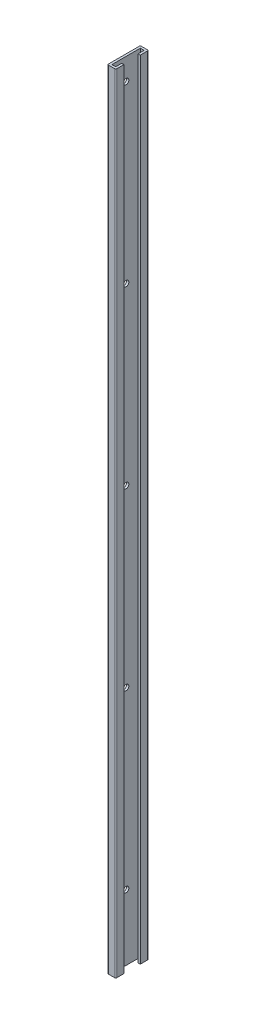
ISO-10303-21;
HEADER;
FILE_DESCRIPTION(('STEP AP214'),'2;1');
FILE_NAME('part.step','',(''),(''),'','','');
FILE_SCHEMA(('AUTOMOTIVE_DESIGN { 1 0 10303 214 1 1 1 1 }'));
ENDSEC;
DATA;
#1=APPLICATION_CONTEXT('core data for automotive mechanical design processes');
#2=APPLICATION_PROTOCOL_DEFINITION('international standard','automotive_design',2000,#1);
#3=PRODUCT_CONTEXT('',#1,'mechanical');
#4=PRODUCT('Part','Part','',(#3));
#5=PRODUCT_RELATED_PRODUCT_CATEGORY('part','',(#4));
#6=PRODUCT_DEFINITION_FORMATION('','',#4);
#7=PRODUCT_DEFINITION_CONTEXT('part definition',#1,'design');
#8=PRODUCT_DEFINITION('design','',#6,#7);
#9=PRODUCT_DEFINITION_SHAPE('','',#8);
#10=(LENGTH_UNIT() NAMED_UNIT(*) SI_UNIT(.MILLI.,.METRE.));
#11=(NAMED_UNIT(*) PLANE_ANGLE_UNIT() SI_UNIT($,.RADIAN.));
#12=(NAMED_UNIT(*) SI_UNIT($,.STERADIAN.) SOLID_ANGLE_UNIT());
#13=UNCERTAINTY_MEASURE_WITH_UNIT(LENGTH_MEASURE(1.E-05),#10,'distance_accuracy_value','');
#14=(GEOMETRIC_REPRESENTATION_CONTEXT(3) GLOBAL_UNCERTAINTY_ASSIGNED_CONTEXT((#13)) GLOBAL_UNIT_ASSIGNED_CONTEXT((#10,
#11,#12)) REPRESENTATION_CONTEXT('',''));
#15=CARTESIAN_POINT('',(0.,0.,0.));
#16=DIRECTION('',(0.,0.,1.));
#17=DIRECTION('',(1.,0.,0.));
#18=AXIS2_PLACEMENT_3D('',#15,#16,#17);
#19=CARTESIAN_POINT('',(2.54,914.4,0.));
#20=DIRECTION('',(0.,0.,1.));
#21=DIRECTION('',(1.,0.,0.));
#22=AXIS2_PLACEMENT_3D('',#19,#20,#21);
#23=PLANE('',#22);
#24=DIRECTION('',(-1.,0.,0.));
#25=VECTOR('',#24,1.);
#26=CARTESIAN_POINT('',(2.54,0.,0.));
#27=LINE('',#26,#25);
#28=CARTESIAN_POINT('',(6.985,0.,0.));
#29=VERTEX_POINT('',#28);
#30=CARTESIAN_POINT('',(2.54,0.,0.));
#31=VERTEX_POINT('',#30);
#32=EDGE_CURVE('E177',#29,#31,#27,.T.);
#33=ORIENTED_EDGE('',*,*,#32,.T.);
#34=DIRECTION('',(0.,-1.,0.));
#35=VECTOR('',#34,1.);
#36=CARTESIAN_POINT('',(2.54,914.4,0.));
#37=LINE('',#36,#35);
#38=CARTESIAN_POINT('',(2.54,914.4,0.));
#39=VERTEX_POINT('',#38);
#40=EDGE_CURVE('E11',#39,#31,#37,.T.);
#41=ORIENTED_EDGE('',*,*,#40,.F.);
#42=DIRECTION('',(-1.,0.,0.));
#43=VECTOR('',#42,1.);
#44=CARTESIAN_POINT('',(2.54,914.4,0.));
#45=LINE('',#44,#43);
#46=CARTESIAN_POINT('',(6.985,914.4,0.));
#47=VERTEX_POINT('',#46);
#48=EDGE_CURVE('E208',#47,#39,#45,.T.);
#49=ORIENTED_EDGE('',*,*,#48,.F.);
#50=DIRECTION('',(0.,-1.,0.));
#51=VECTOR('',#50,1.);
#52=CARTESIAN_POINT('',(6.985,914.4,0.));
#53=LINE('',#52,#51);
#54=EDGE_CURVE('E173',#47,#29,#53,.T.);
#55=ORIENTED_EDGE('',*,*,#54,.T.);
#56=EDGE_LOOP('',(#33,#41,#49,#55));
#57=FACE_BOUND('',#56,.T.);
#58=ADVANCED_FACE('F33',(#57),#23,.F.);
#59=CARTESIAN_POINT('',(2.54,914.4,0.));
#60=DIRECTION('',(-1.,0.,0.));
#61=DIRECTION('',(0.,0.,1.));
#62=AXIS2_PLACEMENT_3D('',#59,#60,#61);
#63=PLANE('',#62);
#64=CARTESIAN_POINT('',(2.54,76.2,-16.51));
#65=DIRECTION('',(1.,0.,0.));
#66=DIRECTION('',(0.,0.,-1.));
#67=AXIS2_PLACEMENT_3D('',#64,#65,#66);
#68=CIRCLE('',#67,3.175);
#69=CARTESIAN_POINT('',(2.54,76.2,-19.685));
#70=VERTEX_POINT('',#69);
#71=EDGE_CURVE('E446',#70,#70,#68,.T.);
#72=ORIENTED_EDGE('',*,*,#71,.F.);
#73=EDGE_LOOP('',(#72));
#74=FACE_BOUND('',#73,.T.);
#75=CARTESIAN_POINT('',(2.54,279.4,-16.51));
#76=DIRECTION('',(1.,0.,0.));
#77=DIRECTION('',(0.,0.,-1.));
#78=AXIS2_PLACEMENT_3D('',#75,#76,#77);
#79=CIRCLE('',#78,3.175);
#80=CARTESIAN_POINT('',(2.54,279.4,-19.685));
#81=VERTEX_POINT('',#80);
#82=EDGE_CURVE('E453',#81,#81,#79,.T.);
#83=ORIENTED_EDGE('',*,*,#82,.F.);
#84=EDGE_LOOP('',(#83));
#85=FACE_BOUND('',#84,.T.);
#86=CARTESIAN_POINT('',(2.54,482.6,-16.51));
#87=DIRECTION('',(1.,0.,0.));
#88=DIRECTION('',(0.,0.,-1.));
#89=AXIS2_PLACEMENT_3D('',#86,#87,#88);
#90=CIRCLE('',#89,3.175);
#91=CARTESIAN_POINT('',(2.54,482.6,-19.685));
#92=VERTEX_POINT('',#91);
#93=EDGE_CURVE('E459',#92,#92,#90,.T.);
#94=ORIENTED_EDGE('',*,*,#93,.F.);
#95=EDGE_LOOP('',(#94));
#96=FACE_BOUND('',#95,.T.);
#97=CARTESIAN_POINT('',(2.54,685.8,-16.51));
#98=DIRECTION('',(1.,0.,0.));
#99=DIRECTION('',(0.,0.,-1.));
#100=AXIS2_PLACEMENT_3D('',#97,#98,#99);
#101=CIRCLE('',#100,3.175);
#102=CARTESIAN_POINT('',(2.54,685.8,-19.685));
#103=VERTEX_POINT('',#102);
#104=EDGE_CURVE('E465',#103,#103,#101,.T.);
#105=ORIENTED_EDGE('',*,*,#104,.F.);
#106=EDGE_LOOP('',(#105));
#107=FACE_BOUND('',#106,.T.);
#108=CARTESIAN_POINT('',(2.54,889.,-16.51));
#109=DIRECTION('',(1.,0.,0.));
#110=DIRECTION('',(0.,0.,-1.));
#111=AXIS2_PLACEMENT_3D('',#108,#109,#110);
#112=CIRCLE('',#111,3.175);
#113=CARTESIAN_POINT('',(2.54,889.,-19.685));
#114=VERTEX_POINT('',#113);
#115=EDGE_CURVE('E471',#114,#114,#112,.T.);
#116=ORIENTED_EDGE('',*,*,#115,.F.);
#117=EDGE_LOOP('',(#116));
#118=FACE_BOUND('',#117,.T.);
#119=DIRECTION('',(0.,0.,-1.));
#120=VECTOR('',#119,1.);
#121=CARTESIAN_POINT('',(2.54,0.,0.));
#122=LINE('',#121,#120);
#123=CARTESIAN_POINT('',(2.54,0.,-33.02));
#124=VERTEX_POINT('',#123);
#125=EDGE_CURVE('E180',#31,#124,#122,.T.);
#126=ORIENTED_EDGE('',*,*,#125,.T.);
#127=DIRECTION('',(0.,-1.,0.));
#128=VECTOR('',#127,1.);
#129=CARTESIAN_POINT('',(2.54,914.4,-33.02));
#130=LINE('',#129,#128);
#131=CARTESIAN_POINT('',(2.54,914.4,-33.02));
#132=VERTEX_POINT('',#131);
#133=EDGE_CURVE('E41',#132,#124,#130,.T.);
#134=ORIENTED_EDGE('',*,*,#133,.F.);
#135=DIRECTION('',(0.,0.,-1.));
#136=VECTOR('',#135,1.);
#137=CARTESIAN_POINT('',(2.54,914.4,0.));
#138=LINE('',#137,#136);
#139=EDGE_CURVE('E116',#39,#132,#138,.T.);
#140=ORIENTED_EDGE('',*,*,#139,.F.);
#141=ORIENTED_EDGE('',*,*,#40,.T.);
#142=EDGE_LOOP('',(#126,#134,#140,#141));
#143=FACE_BOUND('',#142,.T.);
#144=ADVANCED_FACE('F306',(#74,#85,#96,#107,#118,#143),#63,.F.);
#145=CARTESIAN_POINT('',(2.54,914.4,-33.02));
#146=DIRECTION('',(0.,0.,-1.));
#147=DIRECTION('',(-1.,0.,0.));
#148=AXIS2_PLACEMENT_3D('',#145,#146,#147);
#149=PLANE('',#148);
#150=DIRECTION('',(1.,0.,0.));
#151=VECTOR('',#150,1.);
#152=CARTESIAN_POINT('',(2.54,0.,-33.02));
#153=LINE('',#152,#151);
#154=CARTESIAN_POINT('',(6.985,0.,-33.02));
#155=VERTEX_POINT('',#154);
#156=EDGE_CURVE('E183',#124,#155,#153,.T.);
#157=ORIENTED_EDGE('',*,*,#156,.T.);
#158=DIRECTION('',(0.,-1.,0.));
#159=VECTOR('',#158,1.);
#160=CARTESIAN_POINT('',(6.985,914.4,-33.02));
#161=LINE('',#160,#159);
#162=CARTESIAN_POINT('',(6.985,914.4,-33.02));
#163=VERTEX_POINT('',#162);
#164=EDGE_CURVE('E239',#163,#155,#161,.T.);
#165=ORIENTED_EDGE('',*,*,#164,.F.);
#166=DIRECTION('',(1.,0.,0.));
#167=VECTOR('',#166,1.);
#168=CARTESIAN_POINT('',(2.54,914.4,-33.02));
#169=LINE('',#168,#167);
#170=EDGE_CURVE('E247',#132,#163,#169,.T.);
#171=ORIENTED_EDGE('',*,*,#170,.F.);
#172=ORIENTED_EDGE('',*,*,#133,.T.);
#173=EDGE_LOOP('',(#157,#165,#171,#172));
#174=FACE_BOUND('',#173,.T.);
#175=ADVANCED_FACE('F245',(#174),#149,.F.);
#176=CARTESIAN_POINT('',(6.985,914.4,-33.02));
#177=DIRECTION('',(1.,0.,0.));
#178=DIRECTION('',(0.,0.,-1.));
#179=AXIS2_PLACEMENT_3D('',#176,#177,#178);
#180=PLANE('',#179);
#181=DIRECTION('',(0.,0.,1.));
#182=VECTOR('',#181,1.);
#183=CARTESIAN_POINT('',(6.985,0.,-33.02));
#184=LINE('',#183,#182);
#185=CARTESIAN_POINT('',(6.985,0.,-26.035));
#186=VERTEX_POINT('',#185);
#187=EDGE_CURVE('E185',#155,#186,#184,.T.);
#188=ORIENTED_EDGE('',*,*,#187,.T.);
#189=DIRECTION('',(0.,-1.,0.));
#190=VECTOR('',#189,1.);
#191=CARTESIAN_POINT('',(6.985,914.4,-26.035));
#192=LINE('',#191,#190);
#193=CARTESIAN_POINT('',(6.985,914.4,-26.035));
#194=VERTEX_POINT('',#193);
#195=EDGE_CURVE('E236',#194,#186,#192,.T.);
#196=ORIENTED_EDGE('',*,*,#195,.F.);
#197=DIRECTION('',(0.,0.,1.));
#198=VECTOR('',#197,1.);
#199=CARTESIAN_POINT('',(6.985,914.4,-33.02));
#200=LINE('',#199,#198);
#201=EDGE_CURVE('E265',#163,#194,#200,.T.);
#202=ORIENTED_EDGE('',*,*,#201,.F.);
#203=ORIENTED_EDGE('',*,*,#164,.T.);
#204=EDGE_LOOP('',(#188,#196,#202,#203));
#205=FACE_BOUND('',#204,.T.);
#206=ADVANCED_FACE('F256',(#205),#180,.F.);
#207=CARTESIAN_POINT('',(9.525,914.4,-26.035));
#208=DIRECTION('',(0.,0.,-1.));
#209=DIRECTION('',(-1.,0.,0.));
#210=AXIS2_PLACEMENT_3D('',#207,#208,#209);
#211=PLANE('',#210);
#212=DIRECTION('',(1.,0.,0.));
#213=VECTOR('',#212,1.);
#214=CARTESIAN_POINT('',(9.525,0.,-26.035));
#215=LINE('',#214,#213);
#216=CARTESIAN_POINT('',(9.525,0.,-26.035));
#217=VERTEX_POINT('',#216);
#218=EDGE_CURVE('E187',#186,#217,#215,.T.);
#219=ORIENTED_EDGE('',*,*,#218,.T.);
#220=DIRECTION('',(0.,-1.,0.));
#221=VECTOR('',#220,1.);
#222=CARTESIAN_POINT('',(9.525,914.4,-26.035));
#223=LINE('',#222,#221);
#224=CARTESIAN_POINT('',(9.525,914.4,-26.035));
#225=VERTEX_POINT('',#224);
#226=EDGE_CURVE('E233',#225,#217,#223,.T.);
#227=ORIENTED_EDGE('',*,*,#226,.F.);
#228=DIRECTION('',(1.,0.,0.));
#229=VECTOR('',#228,1.);
#230=CARTESIAN_POINT('',(9.525,914.4,-26.035));
#231=LINE('',#230,#229);
#232=EDGE_CURVE('E262',#194,#225,#231,.T.);
#233=ORIENTED_EDGE('',*,*,#232,.F.);
#234=ORIENTED_EDGE('',*,*,#195,.T.);
#235=EDGE_LOOP('',(#219,#227,#233,#234));
#236=FACE_BOUND('',#235,.T.);
#237=ADVANCED_FACE('F260',(#236),#211,.F.);
#238=CARTESIAN_POINT('',(9.525,914.4,-34.29));
#239=DIRECTION('',(-1.,0.,0.));
#240=DIRECTION('',(0.,0.,1.));
#241=AXIS2_PLACEMENT_3D('',#238,#239,#240);
#242=PLANE('',#241);
#243=DIRECTION('',(0.,0.,-1.));
#244=VECTOR('',#243,1.);
#245=CARTESIAN_POINT('',(9.525,0.,-34.29));
#246=LINE('',#245,#244);
#247=CARTESIAN_POINT('',(9.525,0.,-34.29));
#248=VERTEX_POINT('',#247);
#249=EDGE_CURVE('E189',#217,#248,#246,.T.);
#250=ORIENTED_EDGE('',*,*,#249,.T.);
#251=DIRECTION('',(0.,-1.,0.));
#252=VECTOR('',#251,1.);
#253=CARTESIAN_POINT('',(9.525,914.4,-34.29));
#254=LINE('',#253,#252);
#255=CARTESIAN_POINT('',(9.525,914.4,-34.29));
#256=VERTEX_POINT('',#255);
#257=EDGE_CURVE('E230',#256,#248,#254,.T.);
#258=ORIENTED_EDGE('',*,*,#257,.F.);
#259=DIRECTION('',(0.,0.,-1.));
#260=VECTOR('',#259,1.);
#261=CARTESIAN_POINT('',(9.525,914.4,-34.29));
#262=LINE('',#261,#260);
#263=EDGE_CURVE('E264',#225,#256,#262,.T.);
#264=ORIENTED_EDGE('',*,*,#263,.F.);
#265=ORIENTED_EDGE('',*,*,#226,.T.);
#266=EDGE_LOOP('',(#250,#258,#264,#265));
#267=FACE_BOUND('',#266,.T.);
#268=ADVANCED_FACE('F322',(#267),#242,.F.);
#269=CARTESIAN_POINT('',(8.255,914.4,-34.29));
#270=DIRECTION('',(0.,-1.,0.));
#271=DIRECTION('',(0.,0.,-1.));
#272=AXIS2_PLACEMENT_3D('',#269,#270,#271);
#273=CYLINDRICAL_SURFACE('',#272,1.27);
#274=CARTESIAN_POINT('',(8.255,0.,-34.29));
#275=DIRECTION('',(0.,1.,0.));
#276=DIRECTION('',(0.,0.,-1.));
#277=AXIS2_PLACEMENT_3D('',#274,#275,#276);
#278=CIRCLE('',#277,1.27);
#279=CARTESIAN_POINT('',(8.255,0.,-35.56));
#280=VERTEX_POINT('',#279);
#281=EDGE_CURVE('E191',#248,#280,#278,.T.);
#282=ORIENTED_EDGE('',*,*,#281,.T.);
#283=DIRECTION('',(0.,-1.,0.));
#284=VECTOR('',#283,1.);
#285=CARTESIAN_POINT('',(8.255,914.4,-35.56));
#286=LINE('',#285,#284);
#287=CARTESIAN_POINT('',(8.255,914.4,-35.56));
#288=VERTEX_POINT('',#287);
#289=EDGE_CURVE('E227',#288,#280,#286,.T.);
#290=ORIENTED_EDGE('',*,*,#289,.F.);
#291=CARTESIAN_POINT('',(8.255,914.4,-34.29));
#292=DIRECTION('',(0.,1.,0.));
#293=DIRECTION('',(0.,0.,-1.));
#294=AXIS2_PLACEMENT_3D('',#291,#292,#293);
#295=CIRCLE('',#294,1.27);
#296=EDGE_CURVE('E267',#256,#288,#295,.T.);
#297=ORIENTED_EDGE('',*,*,#296,.F.);
#298=ORIENTED_EDGE('',*,*,#257,.T.);
#299=EDGE_LOOP('',(#282,#290,#297,#298));
#300=FACE_BOUND('',#299,.T.);
#301=ADVANCED_FACE('F325',(#300),#273,.T.);
#302=CARTESIAN_POINT('',(1.27,914.4,-35.56));
#303=DIRECTION('',(0.,0.,1.));
#304=DIRECTION('',(1.,0.,0.));
#305=AXIS2_PLACEMENT_3D('',#302,#303,#304);
#306=PLANE('',#305);
#307=DIRECTION('',(-1.,0.,0.));
#308=VECTOR('',#307,1.);
#309=CARTESIAN_POINT('',(1.27,0.,-35.56));
#310=LINE('',#309,#308);
#311=CARTESIAN_POINT('',(1.27,0.,-35.56));
#312=VERTEX_POINT('',#311);
#313=EDGE_CURVE('E193',#280,#312,#310,.T.);
#314=ORIENTED_EDGE('',*,*,#313,.T.);
#315=DIRECTION('',(0.,-1.,0.));
#316=VECTOR('',#315,1.);
#317=CARTESIAN_POINT('',(1.27,914.4,-35.56));
#318=LINE('',#317,#316);
#319=CARTESIAN_POINT('',(1.27,914.4,-35.56));
#320=VERTEX_POINT('',#319);
#321=EDGE_CURVE('E224',#320,#312,#318,.T.);
#322=ORIENTED_EDGE('',*,*,#321,.F.);
#323=DIRECTION('',(-1.,0.,0.));
#324=VECTOR('',#323,1.);
#325=CARTESIAN_POINT('',(1.27,914.4,-35.56));
#326=LINE('',#325,#324);
#327=EDGE_CURVE('E273',#288,#320,#326,.T.);
#328=ORIENTED_EDGE('',*,*,#327,.F.);
#329=ORIENTED_EDGE('',*,*,#289,.T.);
#330=EDGE_LOOP('',(#314,#322,#328,#329));
#331=FACE_BOUND('',#330,.T.);
#332=ADVANCED_FACE('F329',(#331),#306,.F.);
#333=CARTESIAN_POINT('',(1.27,914.4,-34.29));
#334=DIRECTION('',(0.,-1.,0.));
#335=DIRECTION('',(0.,0.,-1.));
#336=AXIS2_PLACEMENT_3D('',#333,#334,#335);
#337=CYLINDRICAL_SURFACE('',#336,1.27);
#338=CARTESIAN_POINT('',(1.27,0.,-34.29));
#339=DIRECTION('',(0.,1.,0.));
#340=DIRECTION('',(0.,0.,-1.));
#341=AXIS2_PLACEMENT_3D('',#338,#339,#340);
#342=CIRCLE('',#341,1.27);
#343=CARTESIAN_POINT('',(0.,0.,-34.29));
#344=VERTEX_POINT('',#343);
#345=EDGE_CURVE('E195',#312,#344,#342,.T.);
#346=ORIENTED_EDGE('',*,*,#345,.T.);
#347=DIRECTION('',(0.,-1.,0.));
#348=VECTOR('',#347,1.);
#349=CARTESIAN_POINT('',(0.,914.4,-34.29));
#350=LINE('',#349,#348);
#351=CARTESIAN_POINT('',(0.,914.4,-34.29));
#352=VERTEX_POINT('',#351);
#353=EDGE_CURVE('E221',#352,#344,#350,.T.);
#354=ORIENTED_EDGE('',*,*,#353,.F.);
#355=CARTESIAN_POINT('',(1.27,914.4,-34.29));
#356=DIRECTION('',(0.,1.,0.));
#357=DIRECTION('',(0.,0.,-1.));
#358=AXIS2_PLACEMENT_3D('',#355,#356,#357);
#359=CIRCLE('',#358,1.27);
#360=EDGE_CURVE('E275',#320,#352,#359,.T.);
#361=ORIENTED_EDGE('',*,*,#360,.F.);
#362=ORIENTED_EDGE('',*,*,#321,.T.);
#363=EDGE_LOOP('',(#346,#354,#361,#362));
#364=FACE_BOUND('',#363,.T.);
#365=ADVANCED_FACE('F333',(#364),#337,.T.);
#366=CARTESIAN_POINT('',(0.,914.4,1.27));
#367=DIRECTION('',(1.,0.,0.));
#368=DIRECTION('',(0.,0.,-1.));
#369=AXIS2_PLACEMENT_3D('',#366,#367,#368);
#370=PLANE('',#369);
#371=CARTESIAN_POINT('',(0.,76.2,-16.51));
#372=DIRECTION('',(1.,0.,0.));
#373=DIRECTION('',(0.,0.,-1.));
#374=AXIS2_PLACEMENT_3D('',#371,#372,#373);
#375=CIRCLE('',#374,3.175);
#376=CARTESIAN_POINT('',(0.,76.2,-19.685));
#377=VERTEX_POINT('',#376);
#378=EDGE_CURVE('E181',#377,#377,#375,.F.);
#379=ORIENTED_EDGE('',*,*,#378,.F.);
#380=EDGE_LOOP('',(#379));
#381=FACE_BOUND('',#380,.T.);
#382=CARTESIAN_POINT('',(0.,279.4,-16.51));
#383=DIRECTION('',(1.,0.,0.));
#384=DIRECTION('',(0.,0.,-1.));
#385=AXIS2_PLACEMENT_3D('',#382,#383,#384);
#386=CIRCLE('',#385,3.175);
#387=CARTESIAN_POINT('',(0.,279.4,-19.685));
#388=VERTEX_POINT('',#387);
#389=EDGE_CURVE('E450',#388,#388,#386,.F.);
#390=ORIENTED_EDGE('',*,*,#389,.F.);
#391=EDGE_LOOP('',(#390));
#392=FACE_BOUND('',#391,.T.);
#393=CARTESIAN_POINT('',(0.,482.6,-16.51));
#394=DIRECTION('',(1.,0.,0.));
#395=DIRECTION('',(0.,0.,-1.));
#396=AXIS2_PLACEMENT_3D('',#393,#394,#395);
#397=CIRCLE('',#396,3.175);
#398=CARTESIAN_POINT('',(0.,482.6,-19.685));
#399=VERTEX_POINT('',#398);
#400=EDGE_CURVE('E456',#399,#399,#397,.F.);
#401=ORIENTED_EDGE('',*,*,#400,.F.);
#402=EDGE_LOOP('',(#401));
#403=FACE_BOUND('',#402,.T.);
#404=CARTESIAN_POINT('',(0.,685.8,-16.51));
#405=DIRECTION('',(1.,0.,0.));
#406=DIRECTION('',(0.,0.,-1.));
#407=AXIS2_PLACEMENT_3D('',#404,#405,#406);
#408=CIRCLE('',#407,3.175);
#409=CARTESIAN_POINT('',(0.,685.8,-19.685));
#410=VERTEX_POINT('',#409);
#411=EDGE_CURVE('E462',#410,#410,#408,.F.);
#412=ORIENTED_EDGE('',*,*,#411,.F.);
#413=EDGE_LOOP('',(#412));
#414=FACE_BOUND('',#413,.T.);
#415=CARTESIAN_POINT('',(0.,889.,-16.51));
#416=DIRECTION('',(1.,0.,0.));
#417=DIRECTION('',(0.,0.,-1.));
#418=AXIS2_PLACEMENT_3D('',#415,#416,#417);
#419=CIRCLE('',#418,3.175);
#420=CARTESIAN_POINT('',(0.,889.,-19.685));
#421=VERTEX_POINT('',#420);
#422=EDGE_CURVE('E468',#421,#421,#419,.F.);
#423=ORIENTED_EDGE('',*,*,#422,.F.);
#424=EDGE_LOOP('',(#423));
#425=FACE_BOUND('',#424,.T.);
#426=DIRECTION('',(0.,0.,1.));
#427=VECTOR('',#426,1.);
#428=CARTESIAN_POINT('',(0.,0.,1.27));
#429=LINE('',#428,#427);
#430=CARTESIAN_POINT('',(0.,0.,1.27));
#431=VERTEX_POINT('',#430);
#432=EDGE_CURVE('E197',#344,#431,#429,.T.);
#433=ORIENTED_EDGE('',*,*,#432,.T.);
#434=DIRECTION('',(0.,-1.,0.));
#435=VECTOR('',#434,1.);
#436=CARTESIAN_POINT('',(0.,914.4,1.27));
#437=LINE('',#436,#435);
#438=CARTESIAN_POINT('',(0.,914.4,1.27));
#439=VERTEX_POINT('',#438);
#440=EDGE_CURVE('E218',#439,#431,#437,.T.);
#441=ORIENTED_EDGE('',*,*,#440,.F.);
#442=DIRECTION('',(0.,0.,1.));
#443=VECTOR('',#442,1.);
#444=CARTESIAN_POINT('',(0.,914.4,1.27));
#445=LINE('',#444,#443);
#446=EDGE_CURVE('E277',#352,#439,#445,.T.);
#447=ORIENTED_EDGE('',*,*,#446,.F.);
#448=ORIENTED_EDGE('',*,*,#353,.T.);
#449=EDGE_LOOP('',(#433,#441,#447,#448));
#450=FACE_BOUND('',#449,.T.);
#451=ADVANCED_FACE('F337',(#381,#392,#403,#414,#425,#450),#370,.F.);
#452=CARTESIAN_POINT('',(1.27,914.4,1.27));
#453=DIRECTION('',(0.,-1.,0.));
#454=DIRECTION('',(0.,0.,-1.));
#455=AXIS2_PLACEMENT_3D('',#452,#453,#454);
#456=CYLINDRICAL_SURFACE('',#455,1.27);
#457=CARTESIAN_POINT('',(1.27,0.,1.27));
#458=DIRECTION('',(0.,1.,0.));
#459=DIRECTION('',(0.,0.,-1.));
#460=AXIS2_PLACEMENT_3D('',#457,#458,#459);
#461=CIRCLE('',#460,1.27);
#462=CARTESIAN_POINT('',(1.27,0.,2.54));
#463=VERTEX_POINT('',#462);
#464=EDGE_CURVE('E199',#431,#463,#461,.T.);
#465=ORIENTED_EDGE('',*,*,#464,.T.);
#466=DIRECTION('',(0.,-1.,0.));
#467=VECTOR('',#466,1.);
#468=CARTESIAN_POINT('',(1.27,914.4,2.54));
#469=LINE('',#468,#467);
#470=CARTESIAN_POINT('',(1.27,914.4,2.54));
#471=VERTEX_POINT('',#470);
#472=EDGE_CURVE('E215',#471,#463,#469,.T.);
#473=ORIENTED_EDGE('',*,*,#472,.F.);
#474=CARTESIAN_POINT('',(1.27,914.4,1.27));
#475=DIRECTION('',(0.,1.,0.));
#476=DIRECTION('',(0.,0.,-1.));
#477=AXIS2_PLACEMENT_3D('',#474,#475,#476);
#478=CIRCLE('',#477,1.27);
#479=EDGE_CURVE('E279',#439,#471,#478,.T.);
#480=ORIENTED_EDGE('',*,*,#479,.F.);
#481=ORIENTED_EDGE('',*,*,#440,.T.);
#482=EDGE_LOOP('',(#465,#473,#480,#481));
#483=FACE_BOUND('',#482,.T.);
#484=ADVANCED_FACE('F341',(#483),#456,.T.);
#485=CARTESIAN_POINT('',(1.27,914.4,2.54));
#486=DIRECTION('',(0.,0.,-1.));
#487=DIRECTION('',(-1.,0.,0.));
#488=AXIS2_PLACEMENT_3D('',#485,#486,#487);
#489=PLANE('',#488);
#490=DIRECTION('',(1.,0.,0.));
#491=VECTOR('',#490,1.);
#492=CARTESIAN_POINT('',(1.27,0.,2.54));
#493=LINE('',#492,#491);
#494=CARTESIAN_POINT('',(8.255,0.,2.54));
#495=VERTEX_POINT('',#494);
#496=EDGE_CURVE('E201',#463,#495,#493,.T.);
#497=ORIENTED_EDGE('',*,*,#496,.T.);
#498=DIRECTION('',(0.,-1.,0.));
#499=VECTOR('',#498,1.);
#500=CARTESIAN_POINT('',(8.255,914.4,2.54));
#501=LINE('',#500,#499);
#502=CARTESIAN_POINT('',(8.255,914.4,2.54));
#503=VERTEX_POINT('',#502);
#504=EDGE_CURVE('E212',#503,#495,#501,.T.);
#505=ORIENTED_EDGE('',*,*,#504,.F.);
#506=DIRECTION('',(1.,0.,0.));
#507=VECTOR('',#506,1.);
#508=CARTESIAN_POINT('',(1.27,914.4,2.54));
#509=LINE('',#508,#507);
#510=EDGE_CURVE('E281',#471,#503,#509,.T.);
#511=ORIENTED_EDGE('',*,*,#510,.F.);
#512=ORIENTED_EDGE('',*,*,#472,.T.);
#513=EDGE_LOOP('',(#497,#505,#511,#512));
#514=FACE_BOUND('',#513,.T.);
#515=ADVANCED_FACE('F287',(#514),#489,.F.);
#516=CARTESIAN_POINT('',(8.255,914.4,1.27));
#517=DIRECTION('',(0.,-1.,0.));
#518=DIRECTION('',(0.,0.,-1.));
#519=AXIS2_PLACEMENT_3D('',#516,#517,#518);
#520=CYLINDRICAL_SURFACE('',#519,1.27);
#521=CARTESIAN_POINT('',(8.255,0.,1.27));
#522=DIRECTION('',(0.,1.,0.));
#523=DIRECTION('',(0.,0.,1.));
#524=AXIS2_PLACEMENT_3D('',#521,#522,#523);
#525=CIRCLE('',#524,1.27);
#526=CARTESIAN_POINT('',(9.525,0.,1.27));
#527=VERTEX_POINT('',#526);
#528=EDGE_CURVE('E203',#495,#527,#525,.T.);
#529=ORIENTED_EDGE('',*,*,#528,.T.);
#530=DIRECTION('',(0.,-1.,0.));
#531=VECTOR('',#530,1.);
#532=CARTESIAN_POINT('',(9.525,914.4,1.27));
#533=LINE('',#532,#531);
#534=CARTESIAN_POINT('',(9.525,914.4,1.27));
#535=VERTEX_POINT('',#534);
#536=EDGE_CURVE('E168',#535,#527,#533,.T.);
#537=ORIENTED_EDGE('',*,*,#536,.F.);
#538=CARTESIAN_POINT('',(8.255,914.4,1.27));
#539=DIRECTION('',(0.,1.,0.));
#540=DIRECTION('',(0.,0.,1.));
#541=AXIS2_PLACEMENT_3D('',#538,#539,#540);
#542=CIRCLE('',#541,1.27);
#543=EDGE_CURVE('E159',#503,#535,#542,.T.);
#544=ORIENTED_EDGE('',*,*,#543,.F.);
#545=ORIENTED_EDGE('',*,*,#504,.T.);
#546=EDGE_LOOP('',(#529,#537,#544,#545));
#547=FACE_BOUND('',#546,.T.);
#548=ADVANCED_FACE('F291',(#547),#520,.T.);
#549=CARTESIAN_POINT('',(9.525,914.4,1.27));
#550=DIRECTION('',(-1.,0.,0.));
#551=DIRECTION('',(0.,0.,1.));
#552=AXIS2_PLACEMENT_3D('',#549,#550,#551);
#553=PLANE('',#552);
#554=DIRECTION('',(0.,0.,-1.));
#555=VECTOR('',#554,1.);
#556=CARTESIAN_POINT('',(9.525,0.,1.27));
#557=LINE('',#556,#555);
#558=CARTESIAN_POINT('',(9.525,0.,-6.985));
#559=VERTEX_POINT('',#558);
#560=EDGE_CURVE('E167',#527,#559,#557,.T.);
#561=ORIENTED_EDGE('',*,*,#560,.T.);
#562=DIRECTION('',(0.,-1.,0.));
#563=VECTOR('',#562,1.);
#564=CARTESIAN_POINT('',(9.525,914.4,-6.985));
#565=LINE('',#564,#563);
#566=CARTESIAN_POINT('',(9.525,914.4,-6.985));
#567=VERTEX_POINT('',#566);
#568=EDGE_CURVE('E164',#567,#559,#565,.T.);
#569=ORIENTED_EDGE('',*,*,#568,.F.);
#570=DIRECTION('',(0.,0.,-1.));
#571=VECTOR('',#570,1.);
#572=CARTESIAN_POINT('',(9.525,914.4,1.27));
#573=LINE('',#572,#571);
#574=EDGE_CURVE('E153',#535,#567,#573,.T.);
#575=ORIENTED_EDGE('',*,*,#574,.F.);
#576=ORIENTED_EDGE('',*,*,#536,.T.);
#577=EDGE_LOOP('',(#561,#569,#575,#576));
#578=FACE_BOUND('',#577,.T.);
#579=ADVANCED_FACE('F165',(#578),#553,.F.);
#580=CARTESIAN_POINT('',(9.525,914.4,-6.985));
#581=DIRECTION('',(0.,0.,1.));
#582=DIRECTION('',(1.,0.,0.));
#583=AXIS2_PLACEMENT_3D('',#580,#581,#582);
#584=PLANE('',#583);
#585=DIRECTION('',(-1.,0.,0.));
#586=VECTOR('',#585,1.);
#587=CARTESIAN_POINT('',(9.525,0.,-6.985));
#588=LINE('',#587,#586);
#589=CARTESIAN_POINT('',(6.985,0.,-6.985));
#590=VERTEX_POINT('',#589);
#591=EDGE_CURVE('E102',#559,#590,#588,.T.);
#592=ORIENTED_EDGE('',*,*,#591,.T.);
#593=DIRECTION('',(0.,-1.,0.));
#594=VECTOR('',#593,1.);
#595=CARTESIAN_POINT('',(6.985,914.4,-6.985));
#596=LINE('',#595,#594);
#597=CARTESIAN_POINT('',(6.985,914.4,-6.985));
#598=VERTEX_POINT('',#597);
#599=EDGE_CURVE('E169',#598,#590,#596,.T.);
#600=ORIENTED_EDGE('',*,*,#599,.F.);
#601=DIRECTION('',(-1.,0.,0.));
#602=VECTOR('',#601,1.);
#603=CARTESIAN_POINT('',(9.525,914.4,-6.985));
#604=LINE('',#603,#602);
#605=EDGE_CURVE('E157',#567,#598,#604,.T.);
#606=ORIENTED_EDGE('',*,*,#605,.F.);
#607=ORIENTED_EDGE('',*,*,#568,.T.);
#608=EDGE_LOOP('',(#592,#600,#606,#607));
#609=FACE_BOUND('',#608,.T.);
#610=ADVANCED_FACE('F171',(#609),#584,.F.);
#611=CARTESIAN_POINT('',(6.985,914.4,0.));
#612=DIRECTION('',(1.,0.,0.));
#613=DIRECTION('',(0.,0.,-1.));
#614=AXIS2_PLACEMENT_3D('',#611,#612,#613);
#615=PLANE('',#614);
#616=DIRECTION('',(0.,0.,1.));
#617=VECTOR('',#616,1.);
#618=CARTESIAN_POINT('',(6.985,0.,0.));
#619=LINE('',#618,#617);
#620=EDGE_CURVE('E108',#590,#29,#619,.T.);
#621=ORIENTED_EDGE('',*,*,#620,.T.);
#622=ORIENTED_EDGE('',*,*,#54,.F.);
#623=DIRECTION('',(0.,0.,1.));
#624=VECTOR('',#623,1.);
#625=CARTESIAN_POINT('',(6.985,914.4,0.));
#626=LINE('',#625,#624);
#627=EDGE_CURVE('E49',#598,#47,#626,.T.);
#628=ORIENTED_EDGE('',*,*,#627,.F.);
#629=ORIENTED_EDGE('',*,*,#599,.T.);
#630=EDGE_LOOP('',(#621,#622,#628,#629));
#631=FACE_BOUND('',#630,.T.);
#632=ADVANCED_FACE('F295',(#631),#615,.F.);
#633=CARTESIAN_POINT('',(8.255,914.4,1.27));
#634=DIRECTION('',(0.,1.,0.));
#635=DIRECTION('',(0.,0.,1.));
#636=AXIS2_PLACEMENT_3D('',#633,#634,#635);
#637=PLANE('',#636);
#638=ORIENTED_EDGE('',*,*,#48,.T.);
#639=ORIENTED_EDGE('',*,*,#139,.T.);
#640=ORIENTED_EDGE('',*,*,#170,.T.);
#641=ORIENTED_EDGE('',*,*,#201,.T.);
#642=ORIENTED_EDGE('',*,*,#232,.T.);
#643=ORIENTED_EDGE('',*,*,#263,.T.);
#644=ORIENTED_EDGE('',*,*,#296,.T.);
#645=ORIENTED_EDGE('',*,*,#327,.T.);
#646=ORIENTED_EDGE('',*,*,#360,.T.);
#647=ORIENTED_EDGE('',*,*,#446,.T.);
#648=ORIENTED_EDGE('',*,*,#479,.T.);
#649=ORIENTED_EDGE('',*,*,#510,.T.);
#650=ORIENTED_EDGE('',*,*,#543,.T.);
#651=ORIENTED_EDGE('',*,*,#574,.T.);
#652=ORIENTED_EDGE('',*,*,#605,.T.);
#653=ORIENTED_EDGE('',*,*,#627,.T.);
#654=EDGE_LOOP('',(#638,#639,#640,#641,#642,#643,#644,#645,#646,#647,#648,#649,#650,#651,#652,#653));
#655=FACE_BOUND('',#654,.T.);
#656=ADVANCED_FACE('F155',(#655),#637,.T.);
#657=CARTESIAN_POINT('',(8.255,0.,1.27));
#658=DIRECTION('',(0.,1.,0.));
#659=DIRECTION('',(0.,0.,1.));
#660=AXIS2_PLACEMENT_3D('',#657,#658,#659);
#661=PLANE('',#660);
#662=ORIENTED_EDGE('',*,*,#32,.F.);
#663=ORIENTED_EDGE('',*,*,#620,.F.);
#664=ORIENTED_EDGE('',*,*,#591,.F.);
#665=ORIENTED_EDGE('',*,*,#560,.F.);
#666=ORIENTED_EDGE('',*,*,#528,.F.);
#667=ORIENTED_EDGE('',*,*,#496,.F.);
#668=ORIENTED_EDGE('',*,*,#464,.F.);
#669=ORIENTED_EDGE('',*,*,#432,.F.);
#670=ORIENTED_EDGE('',*,*,#345,.F.);
#671=ORIENTED_EDGE('',*,*,#313,.F.);
#672=ORIENTED_EDGE('',*,*,#281,.F.);
#673=ORIENTED_EDGE('',*,*,#249,.F.);
#674=ORIENTED_EDGE('',*,*,#218,.F.);
#675=ORIENTED_EDGE('',*,*,#187,.F.);
#676=ORIENTED_EDGE('',*,*,#156,.F.);
#677=ORIENTED_EDGE('',*,*,#125,.F.);
#678=EDGE_LOOP('',(#662,#663,#664,#665,#666,#667,#668,#669,#670,#671,#672,#673,#674,#675,#676,#677));
#679=FACE_BOUND('',#678,.T.);
#680=ADVANCED_FACE('F251',(#679),#661,.F.);
#681=CARTESIAN_POINT('',(-0.000999999999999265,889.,-16.51));
#682=DIRECTION('',(1.,0.,0.));
#683=DIRECTION('',(0.,0.,-1.));
#684=AXIS2_PLACEMENT_3D('',#681,#682,#683);
#685=CYLINDRICAL_SURFACE('',#684,3.175);
#686=ORIENTED_EDGE('',*,*,#115,.T.);
#687=EDGE_LOOP('',(#686));
#688=FACE_BOUND('',#687,.T.);
#689=ORIENTED_EDGE('',*,*,#422,.T.);
#690=EDGE_LOOP('',(#689));
#691=FACE_BOUND('',#690,.T.);
#692=ADVANCED_FACE('F377',(#688,#691),#685,.F.);
#693=CARTESIAN_POINT('',(-0.000999999999999265,685.8,-16.51));
#694=DIRECTION('',(1.,0.,0.));
#695=DIRECTION('',(0.,0.,-1.));
#696=AXIS2_PLACEMENT_3D('',#693,#694,#695);
#697=CYLINDRICAL_SURFACE('',#696,3.175);
#698=ORIENTED_EDGE('',*,*,#104,.T.);
#699=EDGE_LOOP('',(#698));
#700=FACE_BOUND('',#699,.T.);
#701=ORIENTED_EDGE('',*,*,#411,.T.);
#702=EDGE_LOOP('',(#701));
#703=FACE_BOUND('',#702,.T.);
#704=ADVANCED_FACE('F400',(#700,#703),#697,.F.);
#705=CARTESIAN_POINT('',(-0.000999999999999265,482.6,-16.51));
#706=DIRECTION('',(1.,0.,0.));
#707=DIRECTION('',(0.,0.,-1.));
#708=AXIS2_PLACEMENT_3D('',#705,#706,#707);
#709=CYLINDRICAL_SURFACE('',#708,3.175);
#710=ORIENTED_EDGE('',*,*,#93,.T.);
#711=EDGE_LOOP('',(#710));
#712=FACE_BOUND('',#711,.T.);
#713=ORIENTED_EDGE('',*,*,#400,.T.);
#714=EDGE_LOOP('',(#713));
#715=FACE_BOUND('',#714,.T.);
#716=ADVANCED_FACE('F410',(#712,#715),#709,.F.);
#717=CARTESIAN_POINT('',(-0.000999999999999265,279.4,-16.51));
#718=DIRECTION('',(1.,0.,0.));
#719=DIRECTION('',(0.,0.,-1.));
#720=AXIS2_PLACEMENT_3D('',#717,#718,#719);
#721=CYLINDRICAL_SURFACE('',#720,3.175);
#722=ORIENTED_EDGE('',*,*,#82,.T.);
#723=EDGE_LOOP('',(#722));
#724=FACE_BOUND('',#723,.T.);
#725=ORIENTED_EDGE('',*,*,#389,.T.);
#726=EDGE_LOOP('',(#725));
#727=FACE_BOUND('',#726,.T.);
#728=ADVANCED_FACE('F420',(#724,#727),#721,.F.);
#729=CARTESIAN_POINT('',(-0.000999999999999265,76.2,-16.51));
#730=DIRECTION('',(1.,0.,0.));
#731=DIRECTION('',(0.,0.,-1.));
#732=AXIS2_PLACEMENT_3D('',#729,#730,#731);
#733=CYLINDRICAL_SURFACE('',#732,3.175);
#734=ORIENTED_EDGE('',*,*,#71,.T.);
#735=EDGE_LOOP('',(#734));
#736=FACE_BOUND('',#735,.T.);
#737=ORIENTED_EDGE('',*,*,#378,.T.);
#738=EDGE_LOOP('',(#737));
#739=FACE_BOUND('',#738,.T.);
#740=ADVANCED_FACE('F430',(#736,#739),#733,.F.);
#741=CLOSED_SHELL('',(#58,#144,#175,#206,#237,#268,#301,#332,#365,#451,#484,#515,#548,#579,#610,
#632,#656,#680,#692,#704,#716,#728,#740));
#742=MANIFOLD_SOLID_BREP('B2',#741);
#743=ADVANCED_BREP_SHAPE_REPRESENTATION('',(#18,#742),#14);
#744=SHAPE_DEFINITION_REPRESENTATION(#9,#743);
ENDSEC;
END-ISO-10303-21;
